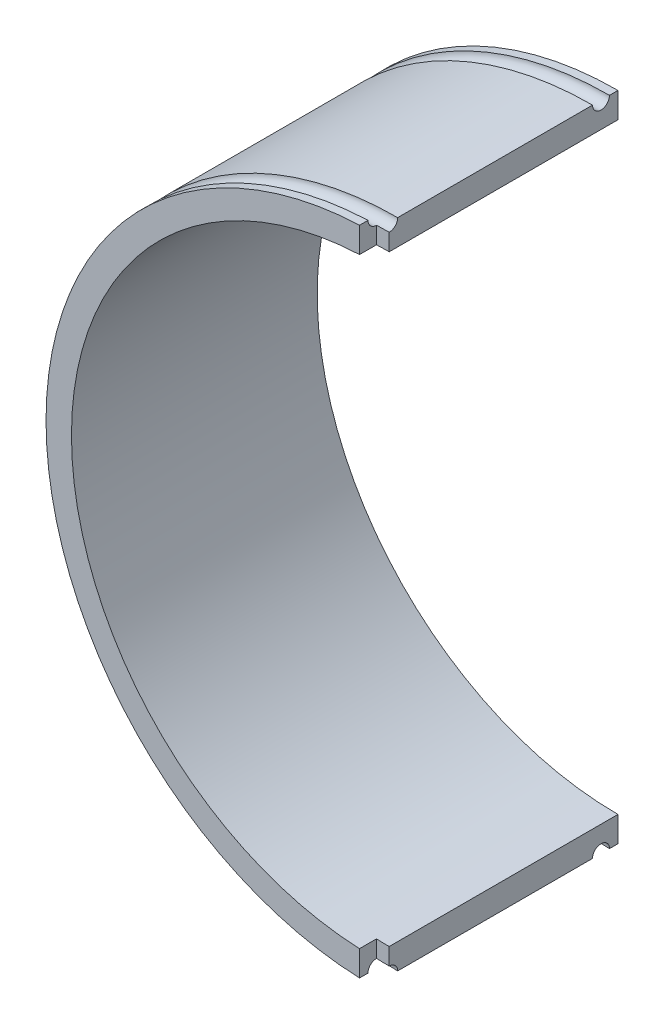
ISO-10303-21;
HEADER;
FILE_DESCRIPTION(('STEP AP214'),'2;1');
FILE_NAME('part.step','',(''),(''),'','','');
FILE_SCHEMA(('AUTOMOTIVE_DESIGN { 1 0 10303 214 1 1 1 1 }'));
ENDSEC;
DATA;
#1=APPLICATION_CONTEXT('core data for automotive mechanical design processes');
#2=APPLICATION_PROTOCOL_DEFINITION('international standard','automotive_design',2000,#1);
#3=PRODUCT_CONTEXT('',#1,'mechanical');
#4=PRODUCT('Part','Part','',(#3));
#5=PRODUCT_RELATED_PRODUCT_CATEGORY('part','',(#4));
#6=PRODUCT_DEFINITION_FORMATION('','',#4);
#7=PRODUCT_DEFINITION_CONTEXT('part definition',#1,'design');
#8=PRODUCT_DEFINITION('design','',#6,#7);
#9=PRODUCT_DEFINITION_SHAPE('','',#8);
#10=(LENGTH_UNIT() NAMED_UNIT(*) SI_UNIT(.MILLI.,.METRE.));
#11=(NAMED_UNIT(*) PLANE_ANGLE_UNIT() SI_UNIT($,.RADIAN.));
#12=(NAMED_UNIT(*) SI_UNIT($,.STERADIAN.) SOLID_ANGLE_UNIT());
#13=UNCERTAINTY_MEASURE_WITH_UNIT(LENGTH_MEASURE(1.E-05),#10,'distance_accuracy_value','');
#14=(GEOMETRIC_REPRESENTATION_CONTEXT(3) GLOBAL_UNCERTAINTY_ASSIGNED_CONTEXT((#13)) GLOBAL_UNIT_ASSIGNED_CONTEXT((#10,
#11,#12)) REPRESENTATION_CONTEXT('',''));
#15=CARTESIAN_POINT('',(0.,0.,0.));
#16=DIRECTION('',(0.,0.,1.));
#17=DIRECTION('',(1.,0.,0.));
#18=AXIS2_PLACEMENT_3D('',#15,#16,#17);
#19=CARTESIAN_POINT('',(0.,-35.5,29.));
#20=DIRECTION('',(-1.,0.,0.));
#21=DIRECTION('',(0.,-1.,0.));
#22=AXIS2_PLACEMENT_3D('',#19,#20,#21);
#23=PLANE('',#22);
#24=DIRECTION('',(0.,1.,0.));
#25=VECTOR('',#24,1.);
#26=CARTESIAN_POINT('',(0.,0.,27.));
#27=LINE('',#26,#25);
#28=CARTESIAN_POINT('',(0.,-37.5,27.));
#29=VERTEX_POINT('',#28);
#30=CARTESIAN_POINT('',(0.,-35.5,27.));
#31=VERTEX_POINT('',#30);
#32=EDGE_CURVE('E123',#29,#31,#27,.T.);
#33=ORIENTED_EDGE('',*,*,#32,.F.);
#34=CARTESIAN_POINT('',(0.,-38.5,27.));
#35=DIRECTION('',(-1.,0.,0.));
#36=DIRECTION('',(0.,-1.,0.));
#37=AXIS2_PLACEMENT_3D('',#34,#35,#36);
#38=CIRCLE('',#37,1.);
#39=CARTESIAN_POINT('',(0.,-38.5,26.));
#40=VERTEX_POINT('',#39);
#41=EDGE_CURVE('E223',#40,#29,#38,.F.);
#42=ORIENTED_EDGE('',*,*,#41,.F.);
#43=DIRECTION('',(0.,0.,-1.));
#44=VECTOR('',#43,1.);
#45=CARTESIAN_POINT('',(0.,-38.5,29.));
#46=LINE('',#45,#44);
#47=CARTESIAN_POINT('',(0.,-38.5,3.));
#48=VERTEX_POINT('',#47);
#49=EDGE_CURVE('E149',#40,#48,#46,.T.);
#50=ORIENTED_EDGE('',*,*,#49,.T.);
#51=CARTESIAN_POINT('',(0.,-38.5,2.));
#52=DIRECTION('',(-1.,0.,0.));
#53=DIRECTION('',(0.,-1.,0.));
#54=AXIS2_PLACEMENT_3D('',#51,#52,#53);
#55=CIRCLE('',#54,1.);
#56=CARTESIAN_POINT('',(0.,-38.5,1.));
#57=VERTEX_POINT('',#56);
#58=EDGE_CURVE('E247',#57,#48,#55,.F.);
#59=ORIENTED_EDGE('',*,*,#58,.F.);
#60=CARTESIAN_POINT('',(0.,-38.5,0.));
#61=VERTEX_POINT('',#60);
#62=EDGE_CURVE('E146',#57,#61,#46,.T.);
#63=ORIENTED_EDGE('',*,*,#62,.T.);
#64=DIRECTION('',(0.,1.,0.));
#65=VECTOR('',#64,1.);
#66=CARTESIAN_POINT('',(0.,-35.5,0.));
#67=LINE('',#66,#65);
#68=CARTESIAN_POINT('',(0.,-35.5,0.));
#69=VERTEX_POINT('',#68);
#70=EDGE_CURVE('E144',#61,#69,#67,.T.);
#71=ORIENTED_EDGE('',*,*,#70,.T.);
#72=DIRECTION('',(0.,0.,-1.));
#73=VECTOR('',#72,1.);
#74=CARTESIAN_POINT('',(0.,-35.5,29.));
#75=LINE('',#74,#73);
#76=EDGE_CURVE('E137',#31,#69,#75,.T.);
#77=ORIENTED_EDGE('',*,*,#76,.F.);
#78=EDGE_LOOP('',(#33,#42,#50,#59,#63,#71,#77));
#79=FACE_BOUND('',#78,.T.);
#80=ADVANCED_FACE('F32',(#79),#23,.F.);
#81=CARTESIAN_POINT('',(0.,0.,29.));
#82=DIRECTION('',(0.,0.,-1.));
#83=DIRECTION('',(-1.,0.,0.));
#84=AXIS2_PLACEMENT_3D('',#81,#82,#83);
#85=CYLINDRICAL_SURFACE('',#84,38.5);
#86=DIRECTION('',(0.,0.,1.));
#87=VECTOR('',#86,1.);
#88=CARTESIAN_POINT('',(-1.50000000000001,-38.4707681233427,27.));
#89=LINE('',#88,#87);
#90=CARTESIAN_POINT('',(-1.50000000000001,-38.4707681233427,28.));
#91=VERTEX_POINT('',#90);
#92=CARTESIAN_POINT('',(-1.50000000000001,-38.4707681233427,29.));
#93=VERTEX_POINT('',#92);
#94=EDGE_CURVE('E141',#91,#93,#89,.T.);
#95=ORIENTED_EDGE('',*,*,#94,.T.);
#96=CARTESIAN_POINT('',(0.,0.,29.));
#97=DIRECTION('',(0.,0.,1.));
#98=DIRECTION('',(1.,0.,0.));
#99=AXIS2_PLACEMENT_3D('',#96,#97,#98);
#100=CIRCLE('',#99,38.5);
#101=CARTESIAN_POINT('',(-1.5,38.4707681233427,29.));
#102=VERTEX_POINT('',#101);
#103=EDGE_CURVE('E208',#102,#93,#100,.T.);
#104=ORIENTED_EDGE('',*,*,#103,.F.);
#105=DIRECTION('',(0.,0.,1.));
#106=VECTOR('',#105,1.);
#107=CARTESIAN_POINT('',(-1.5,38.4707681233427,27.));
#108=LINE('',#107,#106);
#109=CARTESIAN_POINT('',(-1.5,38.4707681233427,28.));
#110=VERTEX_POINT('',#109);
#111=EDGE_CURVE('E262',#110,#102,#108,.T.);
#112=ORIENTED_EDGE('',*,*,#111,.F.);
#113=CARTESIAN_POINT('',(0.,0.,28.));
#114=DIRECTION('',(0.,0.,1.));
#115=DIRECTION('',(1.,0.,0.));
#116=AXIS2_PLACEMENT_3D('',#113,#114,#115);
#117=CIRCLE('',#116,38.5);
#118=EDGE_CURVE('E249',#110,#91,#117,.T.);
#119=ORIENTED_EDGE('',*,*,#118,.T.);
#120=EDGE_LOOP('',(#95,#104,#112,#119));
#121=FACE_BOUND('',#120,.T.);
#122=ADVANCED_FACE('F34',(#121),#85,.T.);
#123=CARTESIAN_POINT('',(0.,0.,29.));
#124=DIRECTION('',(0.,0.,-1.));
#125=DIRECTION('',(-1.,0.,0.));
#126=AXIS2_PLACEMENT_3D('',#123,#124,#125);
#127=CYLINDRICAL_SURFACE('',#126,35.5);
#128=DIRECTION('',(0.,0.,1.));
#129=VECTOR('',#128,1.);
#130=CARTESIAN_POINT('',(-1.50000000000001,-35.4682957019364,27.));
#131=LINE('',#130,#129);
#132=CARTESIAN_POINT('',(-1.50000000000001,-35.4682957019364,27.));
#133=VERTEX_POINT('',#132);
#134=CARTESIAN_POINT('',(-1.50000000000001,-35.4682957019364,29.));
#135=VERTEX_POINT('',#134);
#136=EDGE_CURVE('E140',#133,#135,#131,.T.);
#137=ORIENTED_EDGE('',*,*,#136,.F.);
#138=CARTESIAN_POINT('',(0.,0.,27.));
#139=DIRECTION('',(0.,0.,1.));
#140=DIRECTION('',(1.,0.,0.));
#141=AXIS2_PLACEMENT_3D('',#138,#139,#140);
#142=CIRCLE('',#141,35.5);
#143=EDGE_CURVE('E126',#31,#133,#142,.F.);
#144=ORIENTED_EDGE('',*,*,#143,.F.);
#145=ORIENTED_EDGE('',*,*,#76,.T.);
#146=CARTESIAN_POINT('',(0.,0.,0.));
#147=DIRECTION('',(0.,0.,-1.));
#148=DIRECTION('',(1.,0.,0.));
#149=AXIS2_PLACEMENT_3D('',#146,#147,#148);
#150=CIRCLE('',#149,35.5);
#151=CARTESIAN_POINT('',(0.,35.5,0.));
#152=VERTEX_POINT('',#151);
#153=EDGE_CURVE('E220',#69,#152,#150,.T.);
#154=ORIENTED_EDGE('',*,*,#153,.T.);
#155=DIRECTION('',(0.,0.,-1.));
#156=VECTOR('',#155,1.);
#157=CARTESIAN_POINT('',(0.,35.5,29.));
#158=LINE('',#157,#156);
#159=CARTESIAN_POINT('',(0.,35.5,27.));
#160=VERTEX_POINT('',#159);
#161=EDGE_CURVE('E147',#160,#152,#158,.T.);
#162=ORIENTED_EDGE('',*,*,#161,.F.);
#163=CARTESIAN_POINT('',(0.,0.,27.));
#164=DIRECTION('',(0.,0.,1.));
#165=DIRECTION('',(1.,0.,0.));
#166=AXIS2_PLACEMENT_3D('',#163,#164,#165);
#167=CIRCLE('',#166,35.5);
#168=CARTESIAN_POINT('',(-1.5,35.4682957019364,27.));
#169=VERTEX_POINT('',#168);
#170=EDGE_CURVE('E261',#169,#160,#167,.F.);
#171=ORIENTED_EDGE('',*,*,#170,.F.);
#172=DIRECTION('',(0.,0.,1.));
#173=VECTOR('',#172,1.);
#174=CARTESIAN_POINT('',(-1.5,35.4682957019364,27.));
#175=LINE('',#174,#173);
#176=CARTESIAN_POINT('',(-1.5,35.4682957019364,29.));
#177=VERTEX_POINT('',#176);
#178=EDGE_CURVE('E251',#169,#177,#175,.T.);
#179=ORIENTED_EDGE('',*,*,#178,.T.);
#180=CARTESIAN_POINT('',(0.,0.,29.));
#181=DIRECTION('',(0.,0.,-1.));
#182=DIRECTION('',(1.,0.,0.));
#183=AXIS2_PLACEMENT_3D('',#180,#181,#182);
#184=CIRCLE('',#183,35.5);
#185=EDGE_CURVE('E214',#135,#177,#184,.T.);
#186=ORIENTED_EDGE('',*,*,#185,.F.);
#187=EDGE_LOOP('',(#137,#144,#145,#154,#162,#171,#179,#186));
#188=FACE_BOUND('',#187,.T.);
#189=ADVANCED_FACE('F135',(#188),#127,.F.);
#190=CARTESIAN_POINT('',(0.,0.,29.));
#191=DIRECTION('',(0.,0.,1.));
#192=DIRECTION('',(1.,0.,0.));
#193=AXIS2_PLACEMENT_3D('',#190,#191,#192);
#194=PLANE('',#193);
#195=ORIENTED_EDGE('',*,*,#103,.T.);
#196=DIRECTION('',(0.,1.,0.));
#197=VECTOR('',#196,1.);
#198=CARTESIAN_POINT('',(-1.49999999999999,0.,29.));
#199=LINE('',#198,#197);
#200=EDGE_CURVE('E209',#93,#135,#199,.T.);
#201=ORIENTED_EDGE('',*,*,#200,.T.);
#202=ORIENTED_EDGE('',*,*,#185,.T.);
#203=DIRECTION('',(0.,-1.,0.));
#204=VECTOR('',#203,1.);
#205=CARTESIAN_POINT('',(-1.49999999999999,0.,29.));
#206=LINE('',#205,#204);
#207=EDGE_CURVE('E211',#102,#177,#206,.T.);
#208=ORIENTED_EDGE('',*,*,#207,.F.);
#209=EDGE_LOOP('',(#195,#201,#202,#208));
#210=FACE_BOUND('',#209,.T.);
#211=ADVANCED_FACE('F194',(#210),#194,.T.);
#212=CARTESIAN_POINT('',(0.,0.,27.));
#213=DIRECTION('',(0.,0.,1.));
#214=DIRECTION('',(1.,0.,0.));
#215=AXIS2_PLACEMENT_3D('',#212,#213,#214);
#216=TOROIDAL_SURFACE('',#215,38.5,1.);
#217=CARTESIAN_POINT('',(0.,0.,27.));
#218=DIRECTION('',(0.,0.,-1.));
#219=DIRECTION('',(-1.,0.,0.));
#220=AXIS2_PLACEMENT_3D('',#217,#218,#219);
#221=CIRCLE('',#220,37.5);
#222=CARTESIAN_POINT('',(-1.50000000000001,-37.4699879903904,27.));
#223=VERTEX_POINT('',#222);
#224=EDGE_CURVE('E44',#29,#223,#221,.T.);
#225=ORIENTED_EDGE('',*,*,#224,.T.);
#226=CARTESIAN_POINT('',(-1.50000000000001,-37.8704886954084,27.8001376385593));
#227=CARTESIAN_POINT('',(-1.50000000000001,-37.9155005548234,27.833850839573));
#228=CARTESIAN_POINT('',(-1.50000000000001,-37.9633937284941,27.8637857594443));
#229=CARTESIAN_POINT('',(-1.50000000000001,-38.0635669780838,27.9152129876763));
#230=CARTESIAN_POINT('',(-1.50000000000001,-38.1158523060051,27.9366950087941));
#231=CARTESIAN_POINT('',(-1.50000000000001,-38.2232661143706,27.9705668989888));
#232=CARTESIAN_POINT('',(-1.50000000000001,-38.2783931647313,27.9829612944719));
#233=CARTESIAN_POINT('',(-1.50000000000001,-38.3899302694136,27.9983182089918));
#234=CARTESIAN_POINT('',(-1.50000000000001,-38.4463400002501,28.0012830801058));
#235=CARTESIAN_POINT('',(-1.50000000000001,-38.5588798200001,27.9977043020382));
#236=CARTESIAN_POINT('',(-1.50000000000001,-38.6150097893522,27.991156887687));
#237=CARTESIAN_POINT('',(-1.50000000000001,-38.7253759220652,27.968730695796));
#238=CARTESIAN_POINT('',(-1.50000000000001,-38.7796120095883,27.9528515450338));
#239=CARTESIAN_POINT('',(-1.50000000000001,-38.8846429572613,27.9122123011207));
#240=CARTESIAN_POINT('',(-1.50000000000001,-38.9354381078642,27.8874529586695));
#241=CARTESIAN_POINT('',(-1.50000000000001,-39.032147766724,27.8297538545018));
#242=CARTESIAN_POINT('',(-1.50000000000001,-39.0780622956207,27.7968141273815));
#243=CARTESIAN_POINT('',(-1.50000000000001,-39.1636822435399,27.723706176621));
#244=CARTESIAN_POINT('',(-1.50000000000001,-39.203390757298,27.6835415774189));
#245=CARTESIAN_POINT('',(-1.50000000000001,-39.2754952112294,27.5971118797963));
#246=CARTESIAN_POINT('',(-1.50000000000001,-39.3078911921142,27.5508468153415));
#247=CARTESIAN_POINT('',(-1.50000000000001,-39.3644266375022,27.453564673697));
#248=CARTESIAN_POINT('',(-1.50000000000001,-39.3885719513888,27.4025509958636));
#249=CARTESIAN_POINT('',(-1.50000000000001,-39.4279493777454,27.2971922988368));
#250=CARTESIAN_POINT('',(-1.50000000000001,-39.4431815137596,27.2428472884435));
#251=CARTESIAN_POINT('',(-1.50000000000001,-39.4642913467863,27.132404710253));
#252=CARTESIAN_POINT('',(-1.50000000000001,-39.4701748131317,27.0763082451432));
#253=CARTESIAN_POINT('',(-1.50000000000001,-39.4724376186799,26.9639240346059));
#254=CARTESIAN_POINT('',(-1.50000000000001,-39.4688169820719,26.9076362896656));
#255=CARTESIAN_POINT('',(-1.50000000000001,-39.4521771597281,26.7964832540591));
#256=CARTESIAN_POINT('',(-1.50000000000001,-39.439160512248,26.7416175833769));
#257=CARTESIAN_POINT('',(-1.50000000000001,-39.404102454554,26.6348496826008));
#258=CARTESIAN_POINT('',(-1.50000000000001,-39.3820610405507,26.5829474537513));
#259=CARTESIAN_POINT('',(-1.50000000000001,-39.3295761501481,26.4835687410588));
#260=CARTESIAN_POINT('',(-1.50000000000001,-39.2991311186431,26.436093078538));
#261=CARTESIAN_POINT('',(-1.50000000000001,-39.2307069158591,26.3469231653022));
#262=CARTESIAN_POINT('',(-1.50000000000001,-39.192727725288,26.3052289293915));
#263=CARTESIAN_POINT('',(-1.50000000000001,-39.110290842969,26.228779670475));
#264=CARTESIAN_POINT('',(-1.50000000000001,-39.0658294966234,26.1940285883479));
#265=CARTESIAN_POINT('',(-1.50000000000001,-38.971707125898,26.1324777583329));
#266=CARTESIAN_POINT('',(-1.50000000000001,-38.9220460810849,26.1056780416934));
#267=CARTESIAN_POINT('',(-1.50000000000001,-38.8188958982076,26.0607706038393));
#268=CARTESIAN_POINT('',(-1.50000000000001,-38.765404044189,26.0426691209911));
#269=CARTESIAN_POINT('',(-1.50000000000001,-38.6561414924207,26.015697888838));
#270=CARTESIAN_POINT('',(-1.50000000000001,-38.6003707868661,26.0068281711533));
#271=CARTESIAN_POINT('',(-1.50000000000001,-38.4880999847333,25.9985683704003));
#272=CARTESIAN_POINT('',(-1.50000000000001,-38.4315994939831,25.9991836442974));
#273=CARTESIAN_POINT('',(-1.50000000000001,-38.3195033348783,26.0098893609351));
#274=CARTESIAN_POINT('',(-1.50000000000001,-38.2639076683927,26.019979823245));
#275=CARTESIAN_POINT('',(-1.50000000000001,-38.1551903133885,26.0493530892145));
#276=CARTESIAN_POINT('',(-1.50000000000001,-38.1020690278816,26.0686373846009));
#277=CARTESIAN_POINT('',(-1.50000000000001,-37.9998195445869,26.1158533897111));
#278=CARTESIAN_POINT('',(-1.50000000000001,-37.9506913382808,26.1437850809872));
#279=CARTESIAN_POINT('',(-1.50000000000001,-37.8578408083122,26.207494386748));
#280=CARTESIAN_POINT('',(-1.50000000000001,-37.8141167052527,26.243269407857));
#281=CARTESIAN_POINT('',(-1.50000000000001,-37.7333003078607,26.3216570103919));
#282=CARTESIAN_POINT('',(-1.50000000000001,-37.6962080025891,26.3642695805391));
#283=CARTESIAN_POINT('',(-1.50000000000001,-37.6297360683572,26.4550912444281));
#284=CARTESIAN_POINT('',(-1.50000000000001,-37.6003511075183,26.5032964357655));
#285=CARTESIAN_POINT('',(-1.50000000000001,-37.5500982107521,26.6039588611313));
#286=CARTESIAN_POINT('',(-1.50000000000001,-37.5292302553667,26.6564160854449));
#287=CARTESIAN_POINT('',(-1.50000000000001,-37.4966192349935,26.7640522289042));
#288=CARTESIAN_POINT('',(-1.50000000000001,-37.4848695312017,26.8192291367182));
#289=CARTESIAN_POINT('',(-1.50000000000001,-37.4708055818746,26.93077043553));
#290=CARTESIAN_POINT('',(-1.50000000000001,-37.4684909353883,26.9871347759646));
#291=CARTESIAN_POINT('',(-1.50000000000001,-37.4733603322713,27.0994194501321));
#292=CARTESIAN_POINT('',(-1.50000000000001,-37.4805390407764,27.1553400154876));
#293=CARTESIAN_POINT('',(-1.50000000000001,-37.5041854478806,27.2651973042583));
#294=CARTESIAN_POINT('',(-1.50000000000001,-37.5206554520029,27.3191335317441));
#295=CARTESIAN_POINT('',(-1.50000000000001,-37.5624221893765,27.4234996385031));
#296=CARTESIAN_POINT('',(-1.50000000000001,-37.5877235707593,27.4739276545387));
#297=CARTESIAN_POINT('',(-1.50000000000001,-37.6464147686222,27.5697762522316));
#298=CARTESIAN_POINT('',(-1.50000000000001,-37.6797948338198,27.6152027754261));
#299=CARTESIAN_POINT('',(-1.50000000000001,-37.7397584270062,27.683872270209));
#300=CARTESIAN_POINT('',(-1.50000000000001,-37.7641807764938,27.7090356485753));
#301=CARTESIAN_POINT('',(-1.50000000000001,-37.8155255881384,27.756667323667));
#302=CARTESIAN_POINT('',(-1.50000000000001,-37.842448050491,27.7791356201815));
#303=CARTESIAN_POINT('',(-1.50000000000001,-37.8704886954084,27.8001376385593));
#304=B_SPLINE_CURVE_WITH_KNOTS('',3,(#226,#227,#228,#229,#230,#231,#232,#233,#234,#235,#236,
#237,#238,#239,#240,#241,#242,#243,#244,#245,#246,#247,#248,#249,#250,#251,#252,#253,#254,#255,
#256,#257,#258,#259,#260,#261,#262,#263,#264,#265,#266,#267,#268,#269,#270,#271,#272,#273,#274,
#275,#276,#277,#278,#279,#280,#281,#282,#283,#284,#285,#286,#287,#288,#289,#290,#291,#292,#293,
#294,#295,#296,#297,#298,#299,#300,#301,#302,#303),.UNSPECIFIED.,.T.,.F.,(4,2,2,2,2,2,2,2,2,2,2,
2,2,2,2,2,2,2,2,2,2,2,2,2,2,2,2,2,2,2,2,2,2,2,2,2,2,2,4),(0.,0.168584295670334,
0.337373129823591,0.506077835642047,0.674740456872754,0.843469856631679,1.01220600517367,
1.18092789272227,1.34964906672916,1.51828583472465,1.68692166383164,1.85543768781543,
2.02395326665924,2.19236480924649,2.36077592320515,2.52914155929163,2.69750726607313,
2.86590415016801,3.03430146546615,3.20279409188761,3.37128738046284,3.5399013325948,
3.70851586225411,3.87722562608054,4.04593573834791,4.21467323365415,4.38341036899015,
4.55209179576764,4.72077294430321,4.88933709095574,5.05790085249953,5.22634177092866,
5.39477553123913,5.56311467910554,5.73149561668976,5.89996531051485,6.0682326603071,
6.17325413831375,6.27827562453918),.UNSPECIFIED.);
#305=EDGE_CURVE('E11',#223,#91,#304,.T.);
#306=ORIENTED_EDGE('',*,*,#305,.T.);
#307=ORIENTED_EDGE('',*,*,#118,.F.);
#308=CARTESIAN_POINT('',(-1.5,37.5561839082108,27.4060003784822));
#309=CARTESIAN_POINT('',(-1.5,37.579010273908,27.4573335272841));
#310=CARTESIAN_POINT('',(-1.5,37.6061908699777,27.506775466219));
#311=CARTESIAN_POINT('',(-1.5,37.6684923304027,27.6004334959236));
#312=CARTESIAN_POINT('',(-1.5,37.7036227761084,27.6446431819182));
#313=CARTESIAN_POINT('',(-1.5,37.780792575263,27.7265182806469));
#314=CARTESIAN_POINT('',(-1.5,37.8228283967808,27.7641870187604));
#315=CARTESIAN_POINT('',(-1.5,37.9126129940106,27.8319265221319));
#316=CARTESIAN_POINT('',(-1.5,37.960360351309,27.8619991680692));
#317=CARTESIAN_POINT('',(-1.5,38.060255553035,27.9137284774088));
#318=CARTESIAN_POINT('',(-1.5,38.1124062979918,27.9353795400077));
#319=CARTESIAN_POINT('',(-1.5,38.2196031388135,27.9696258464323));
#320=CARTESIAN_POINT('',(-1.5,38.2746493591682,27.9822207005477));
#321=CARTESIAN_POINT('',(-1.5,38.3861076968199,27.9980023061689));
#322=CARTESIAN_POINT('',(-1.5,38.4425206040403,28.0011834792875));
#323=CARTESIAN_POINT('',(-1.5,38.5550799799743,27.9980317562201));
#324=CARTESIAN_POINT('',(-1.5,38.6112264487435,27.9916988620234));
#325=CARTESIAN_POINT('',(-1.5,38.7216702551254,27.9696956198574));
#326=CARTESIAN_POINT('',(-1.5,38.7759672367466,27.9540234848767));
#327=CARTESIAN_POINT('',(-1.5,38.8811581332296,27.9137833452073));
#328=CARTESIAN_POINT('',(-1.5,38.9320520575125,27.8892153651472));
#329=CARTESIAN_POINT('',(-1.5,39.0289752387935,27.8318875114386));
#330=CARTESIAN_POINT('',(-1.5,39.0750059392297,27.7991300782479));
#331=CARTESIAN_POINT('',(-1.5,39.1609100602695,27.7263476386482));
#332=CARTESIAN_POINT('',(-1.5,39.2007834936184,27.6863226472833));
#333=CARTESIAN_POINT('',(-1.5,39.2732135188423,27.6001684442434));
#334=CARTESIAN_POINT('',(-1.5,39.3057747809075,27.5540431588354));
#335=CARTESIAN_POINT('',(-1.5,39.3626849509728,27.4569776191986));
#336=CARTESIAN_POINT('',(-1.5,39.3870338946789,27.4060373859057));
#337=CARTESIAN_POINT('',(-1.5,39.4268107056614,27.3008264483663));
#338=CARTESIAN_POINT('',(-1.5,39.4422448264321,27.2465581083234));
#339=CARTESIAN_POINT('',(-1.5,39.4637783046451,27.136200017211));
#340=CARTESIAN_POINT('',(-1.5,39.4698776897867,27.0801102715468));
#341=CARTESIAN_POINT('',(-1.5,39.4725670698866,26.9677298592435));
#342=CARTESIAN_POINT('',(-1.5,39.4691615508789,26.9114392999073));
#343=CARTESIAN_POINT('',(-1.5,39.4529478821835,26.8002291019109));
#344=CARTESIAN_POINT('',(-1.5,39.4401397423475,26.7453094618144));
#345=CARTESIAN_POINT('',(-1.5,39.4054867659475,26.6384024328252));
#346=CARTESIAN_POINT('',(-1.5,39.383642380998,26.5864148975389));
#347=CARTESIAN_POINT('',(-1.5,39.331538992262,26.4868430895125));
#348=CARTESIAN_POINT('',(-1.5,39.3012799754993,26.4392588235629));
#349=CARTESIAN_POINT('',(-1.5,39.2331945815637,26.3498236371794));
#350=CARTESIAN_POINT('',(-1.5,39.1953652446662,26.3079749699751));
#351=CARTESIAN_POINT('',(-1.5,39.1132219572665,26.2312173603303));
#352=CARTESIAN_POINT('',(-1.5,39.0689079855152,26.196308440631));
#353=CARTESIAN_POINT('',(-1.5,38.9750215129205,26.1343959483278));
#354=CARTESIAN_POINT('',(-1.5,38.925445482951,26.1073977274472));
#355=CARTESIAN_POINT('',(-1.5,38.8224666981969,26.0621010642488));
#356=CARTESIAN_POINT('',(-1.5,38.7690639267878,26.043802659728));
#357=CARTESIAN_POINT('',(-1.5,38.659908621654,26.0164127529627));
#358=CARTESIAN_POINT('',(-1.5,38.6041545145582,26.0073275207893));
#359=CARTESIAN_POINT('',(-1.5,38.4919123493778,25.9986422727458));
#360=CARTESIAN_POINT('',(-1.5,38.4354242900193,25.9990422733393));
#361=CARTESIAN_POINT('',(-1.5,38.3232943068859,26.0093180599938));
#362=CARTESIAN_POINT('',(-1.5,38.2676527227941,26.0191975532419));
#363=CARTESIAN_POINT('',(-1.5,38.1588179672369,26.0481584323866));
#364=CARTESIAN_POINT('',(-1.5,38.1056248010938,26.0672398382851));
#365=CARTESIAN_POINT('',(-1.5,38.0032024972994,26.1140628621499));
#366=CARTESIAN_POINT('',(-1.5,37.9539730333105,26.1418037662476));
#367=CARTESIAN_POINT('',(-1.5,37.860873325825,26.2051610142598));
#368=CARTESIAN_POINT('',(-1.5,37.817003080334,26.2407773552436));
#369=CARTESIAN_POINT('',(-1.5,37.7358924022986,26.3188554458306));
#370=CARTESIAN_POINT('',(-1.5,37.6986485510879,26.361313643933));
#371=CARTESIAN_POINT('',(-1.5,37.631825640958,26.4518826277714));
#372=CARTESIAN_POINT('',(-1.5,37.6022462494266,26.4999931680828));
#373=CARTESIAN_POINT('',(-1.5,37.5516163678829,26.6004573457788));
#374=CARTESIAN_POINT('',(-1.5,37.5305584936071,26.6528072621403));
#375=CARTESIAN_POINT('',(-1.5,37.4975321246247,26.7603153914782));
#376=CARTESIAN_POINT('',(-1.5,37.4855658576943,26.815474289227));
#377=CARTESIAN_POINT('',(-1.5,37.4710721322005,26.9270038094179));
#378=CARTESIAN_POINT('',(-1.5,37.4685431029259,26.9833742286463));
#379=CARTESIAN_POINT('',(-1.5,37.4729975713046,27.0956911455507));
#380=CARTESIAN_POINT('',(-1.5,37.4799695920849,27.1516380727446));
#381=CARTESIAN_POINT('',(-1.5,37.4988092072154,27.240823761569));
#382=CARTESIAN_POINT('',(-1.5,37.5078475605594,27.2746858342788));
#383=CARTESIAN_POINT('',(-1.5,37.5294214245708,27.3412769533066));
#384=CARTESIAN_POINT('',(-1.5,37.5419569340215,27.3740060000188));
#385=CARTESIAN_POINT('',(-1.5,37.5561839082108,27.4060003784822));
#386=B_SPLINE_CURVE_WITH_KNOTS('',3,(#308,#309,#310,#311,#312,#313,#314,#315,#316,#317,#318,
#319,#320,#321,#322,#323,#324,#325,#326,#327,#328,#329,#330,#331,#332,#333,#334,#335,#336,#337,
#338,#339,#340,#341,#342,#343,#344,#345,#346,#347,#348,#349,#350,#351,#352,#353,#354,#355,#356,
#357,#358,#359,#360,#361,#362,#363,#364,#365,#366,#367,#368,#369,#370,#371,#372,#373,#374,#375,
#376,#377,#378,#379,#380,#381,#382,#383,#384,#385),.UNSPECIFIED.,.T.,.F.,(4,2,2,2,2,2,2,2,2,2,2,
2,2,2,2,2,2,2,2,2,2,2,2,2,2,2,2,2,2,2,2,2,2,2,2,2,2,2,4),(0.,0.168410544000819,
0.337025151791861,0.505553784322487,0.674040650685096,0.842639379017359,1.01124536211936,
1.17995123826879,1.34865707914357,1.51739521130442,1.68613287630882,1.85482031728741,
2.02350740908167,2.19208645421991,2.36066476639082,2.52912468161603,2.69758409696211,
2.8659640178854,3.03434376238428,3.2027150925986,3.37108668246305,3.53952422865988,
3.70796232681334,3.87651411451237,4.04506663448906,4.21373378691079,4.38240123209117,
4.55113466568991,4.71986846606143,4.8885883600884,5.05730819132986,5.2259407232107,
5.39456593577346,5.5630447127713,5.73156475992478,5.90005675775248,6.0683454045707,
6.17331057195653,6.27827570282694),.UNSPECIFIED.);
#387=CARTESIAN_POINT('',(-1.5,37.4699879903904,27.));
#388=VERTEX_POINT('',#387);
#389=EDGE_CURVE('E161',#388,#110,#386,.T.);
#390=ORIENTED_EDGE('',*,*,#389,.F.);
#391=CARTESIAN_POINT('',(0.,0.,27.));
#392=DIRECTION('',(0.,0.,-1.));
#393=DIRECTION('',(-1.,0.,0.));
#394=AXIS2_PLACEMENT_3D('',#391,#392,#393);
#395=CIRCLE('',#394,37.5);
#396=CARTESIAN_POINT('',(0.,37.5,27.));
#397=VERTEX_POINT('',#396);
#398=EDGE_CURVE('E159',#388,#397,#395,.T.);
#399=ORIENTED_EDGE('',*,*,#398,.T.);
#400=CARTESIAN_POINT('',(0.,38.5,27.));
#401=DIRECTION('',(-1.,0.,0.));
#402=DIRECTION('',(0.,-1.,0.));
#403=AXIS2_PLACEMENT_3D('',#400,#401,#402);
#404=CIRCLE('',#403,1.);
#405=CARTESIAN_POINT('',(0.,38.5,26.));
#406=VERTEX_POINT('',#405);
#407=EDGE_CURVE('E155',#397,#406,#404,.F.);
#408=ORIENTED_EDGE('',*,*,#407,.T.);
#409=CARTESIAN_POINT('',(0.,0.,26.));
#410=DIRECTION('',(0.,0.,1.));
#411=DIRECTION('',(1.,0.,0.));
#412=AXIS2_PLACEMENT_3D('',#409,#410,#411);
#413=CIRCLE('',#412,38.5);
#414=EDGE_CURVE('E241',#406,#40,#413,.T.);
#415=ORIENTED_EDGE('',*,*,#414,.T.);
#416=ORIENTED_EDGE('',*,*,#41,.T.);
#417=EDGE_LOOP('',(#225,#306,#307,#390,#399,#408,#415,#416));
#418=FACE_BOUND('',#417,.T.);
#419=ADVANCED_FACE('F165',(#418),#216,.F.);
#420=CARTESIAN_POINT('',(0.,38.5,29.));
#421=DIRECTION('',(-1.,0.,0.));
#422=DIRECTION('',(0.,-1.,0.));
#423=AXIS2_PLACEMENT_3D('',#420,#421,#422);
#424=PLANE('',#423);
#425=DIRECTION('',(0.,1.,0.));
#426=VECTOR('',#425,1.);
#427=CARTESIAN_POINT('',(0.,0.,27.));
#428=LINE('',#427,#426);
#429=EDGE_CURVE('E59',#160,#397,#428,.T.);
#430=ORIENTED_EDGE('',*,*,#429,.F.);
#431=ORIENTED_EDGE('',*,*,#161,.T.);
#432=DIRECTION('',(0.,1.,0.));
#433=VECTOR('',#432,1.);
#434=CARTESIAN_POINT('',(0.,38.5,0.));
#435=LINE('',#434,#433);
#436=CARTESIAN_POINT('',(0.,38.5,0.));
#437=VERTEX_POINT('',#436);
#438=EDGE_CURVE('E215',#152,#437,#435,.T.);
#439=ORIENTED_EDGE('',*,*,#438,.T.);
#440=DIRECTION('',(0.,0.,-1.));
#441=VECTOR('',#440,1.);
#442=CARTESIAN_POINT('',(0.,38.5,29.));
#443=LINE('',#442,#441);
#444=CARTESIAN_POINT('',(0.,38.5,1.));
#445=VERTEX_POINT('',#444);
#446=EDGE_CURVE('E217',#445,#437,#443,.T.);
#447=ORIENTED_EDGE('',*,*,#446,.F.);
#448=CARTESIAN_POINT('',(0.,38.5,2.));
#449=DIRECTION('',(-1.,0.,0.));
#450=DIRECTION('',(0.,-1.,0.));
#451=AXIS2_PLACEMENT_3D('',#448,#449,#450);
#452=CIRCLE('',#451,1.);
#453=CARTESIAN_POINT('',(0.,38.5,3.00000000000001));
#454=VERTEX_POINT('',#453);
#455=EDGE_CURVE('E157',#454,#445,#452,.F.);
#456=ORIENTED_EDGE('',*,*,#455,.F.);
#457=EDGE_CURVE('E151',#406,#454,#443,.T.);
#458=ORIENTED_EDGE('',*,*,#457,.F.);
#459=ORIENTED_EDGE('',*,*,#407,.F.);
#460=EDGE_LOOP('',(#430,#431,#439,#447,#456,#458,#459));
#461=FACE_BOUND('',#460,.T.);
#462=ADVANCED_FACE('F195',(#461),#424,.F.);
#463=CARTESIAN_POINT('',(0.,0.,3.));
#464=DIRECTION('',(0.,0.,1.));
#465=DIRECTION('',(1.,0.,0.));
#466=AXIS2_PLACEMENT_3D('',#463,#464,#465);
#467=CIRCLE('',#466,38.5);
#468=EDGE_CURVE('E239',#454,#48,#467,.T.);
#469=ORIENTED_EDGE('',*,*,#468,.T.);
#470=ORIENTED_EDGE('',*,*,#49,.F.);
#471=ORIENTED_EDGE('',*,*,#414,.F.);
#472=ORIENTED_EDGE('',*,*,#457,.T.);
#473=EDGE_LOOP('',(#469,#470,#471,#472));
#474=FACE_BOUND('',#473,.T.);
#475=ADVANCED_FACE('F190',(#474),#85,.T.);
#476=CARTESIAN_POINT('',(0.,0.,1.));
#477=DIRECTION('',(0.,0.,1.));
#478=DIRECTION('',(1.,0.,0.));
#479=AXIS2_PLACEMENT_3D('',#476,#477,#478);
#480=CIRCLE('',#479,38.5);
#481=EDGE_CURVE('E244',#445,#57,#480,.T.);
#482=ORIENTED_EDGE('',*,*,#481,.F.);
#483=ORIENTED_EDGE('',*,*,#446,.T.);
#484=CARTESIAN_POINT('',(0.,0.,0.));
#485=DIRECTION('',(0.,0.,1.));
#486=DIRECTION('',(1.,0.,0.));
#487=AXIS2_PLACEMENT_3D('',#484,#485,#486);
#488=CIRCLE('',#487,38.5);
#489=EDGE_CURVE('E226',#437,#61,#488,.T.);
#490=ORIENTED_EDGE('',*,*,#489,.T.);
#491=ORIENTED_EDGE('',*,*,#62,.F.);
#492=EDGE_LOOP('',(#482,#483,#490,#491));
#493=FACE_BOUND('',#492,.T.);
#494=ADVANCED_FACE('F182',(#493),#85,.T.);
#495=CARTESIAN_POINT('',(0.,0.,0.));
#496=DIRECTION('',(0.,0.,1.));
#497=DIRECTION('',(1.,0.,0.));
#498=AXIS2_PLACEMENT_3D('',#495,#496,#497);
#499=PLANE('',#498);
#500=ORIENTED_EDGE('',*,*,#489,.F.);
#501=ORIENTED_EDGE('',*,*,#438,.F.);
#502=ORIENTED_EDGE('',*,*,#153,.F.);
#503=ORIENTED_EDGE('',*,*,#70,.F.);
#504=EDGE_LOOP('',(#500,#501,#502,#503));
#505=FACE_BOUND('',#504,.T.);
#506=ADVANCED_FACE('F177',(#505),#499,.F.);
#507=CARTESIAN_POINT('',(0.,0.,2.));
#508=DIRECTION('',(0.,0.,1.));
#509=DIRECTION('',(1.,0.,0.));
#510=AXIS2_PLACEMENT_3D('',#507,#508,#509);
#511=TOROIDAL_SURFACE('',#510,38.5,1.);
#512=ORIENTED_EDGE('',*,*,#58,.T.);
#513=ORIENTED_EDGE('',*,*,#468,.F.);
#514=ORIENTED_EDGE('',*,*,#455,.T.);
#515=ORIENTED_EDGE('',*,*,#481,.T.);
#516=EDGE_LOOP('',(#512,#513,#514,#515));
#517=FACE_BOUND('',#516,.T.);
#518=ADVANCED_FACE('F174',(#517),#511,.F.);
#519=CARTESIAN_POINT('',(-1.49999999999999,0.,27.));
#520=DIRECTION('',(-1.,0.,0.));
#521=DIRECTION('',(0.,-1.,0.));
#522=AXIS2_PLACEMENT_3D('',#519,#520,#521);
#523=PLANE('',#522);
#524=ORIENTED_EDGE('',*,*,#389,.T.);
#525=ORIENTED_EDGE('',*,*,#111,.T.);
#526=ORIENTED_EDGE('',*,*,#207,.T.);
#527=ORIENTED_EDGE('',*,*,#178,.F.);
#528=DIRECTION('',(0.,-1.,0.));
#529=VECTOR('',#528,1.);
#530=CARTESIAN_POINT('',(-1.49999999999999,0.,27.));
#531=LINE('',#530,#529);
#532=EDGE_CURVE('E264',#388,#169,#531,.T.);
#533=ORIENTED_EDGE('',*,*,#532,.F.);
#534=EDGE_LOOP('',(#524,#525,#526,#527,#533));
#535=FACE_BOUND('',#534,.T.);
#536=ADVANCED_FACE('F169',(#535),#523,.F.);
#537=CARTESIAN_POINT('',(0.,0.,27.));
#538=DIRECTION('',(0.,0.,1.));
#539=DIRECTION('',(1.,0.,0.));
#540=AXIS2_PLACEMENT_3D('',#537,#538,#539);
#541=PLANE('',#540);
#542=ORIENTED_EDGE('',*,*,#532,.T.);
#543=ORIENTED_EDGE('',*,*,#170,.T.);
#544=ORIENTED_EDGE('',*,*,#429,.T.);
#545=ORIENTED_EDGE('',*,*,#398,.F.);
#546=EDGE_LOOP('',(#542,#543,#544,#545));
#547=FACE_BOUND('',#546,.T.);
#548=ADVANCED_FACE('F173',(#547),#541,.T.);
#549=CARTESIAN_POINT('',(-1.49999999999999,0.,27.));
#550=DIRECTION('',(1.,0.,0.));
#551=DIRECTION('',(0.,1.,0.));
#552=AXIS2_PLACEMENT_3D('',#549,#550,#551);
#553=PLANE('',#552);
#554=DIRECTION('',(0.,1.,0.));
#555=VECTOR('',#554,1.);
#556=CARTESIAN_POINT('',(-1.49999999999999,0.,27.));
#557=LINE('',#556,#555);
#558=EDGE_CURVE('E51',#223,#133,#557,.T.);
#559=ORIENTED_EDGE('',*,*,#558,.T.);
#560=ORIENTED_EDGE('',*,*,#136,.T.);
#561=ORIENTED_EDGE('',*,*,#200,.F.);
#562=ORIENTED_EDGE('',*,*,#94,.F.);
#563=ORIENTED_EDGE('',*,*,#305,.F.);
#564=EDGE_LOOP('',(#559,#560,#561,#562,#563));
#565=FACE_BOUND('',#564,.T.);
#566=ADVANCED_FACE('F274',(#565),#553,.T.);
#567=CARTESIAN_POINT('',(0.,0.,27.));
#568=DIRECTION('',(0.,0.,1.));
#569=DIRECTION('',(1.,0.,0.));
#570=AXIS2_PLACEMENT_3D('',#567,#568,#569);
#571=PLANE('',#570);
#572=ORIENTED_EDGE('',*,*,#32,.T.);
#573=ORIENTED_EDGE('',*,*,#143,.T.);
#574=ORIENTED_EDGE('',*,*,#558,.F.);
#575=ORIENTED_EDGE('',*,*,#224,.F.);
#576=EDGE_LOOP('',(#572,#573,#574,#575));
#577=FACE_BOUND('',#576,.T.);
#578=ADVANCED_FACE('F125',(#577),#571,.T.);
#579=CLOSED_SHELL('',(#80,#122,#189,#211,#419,#462,#475,#494,#506,#518,#536,#548,#566,#578));
#580=MANIFOLD_SOLID_BREP('B2',#579);
#581=ADVANCED_BREP_SHAPE_REPRESENTATION('',(#18,#580),#14);
#582=SHAPE_DEFINITION_REPRESENTATION(#9,#581);
ENDSEC;
END-ISO-10303-21;
